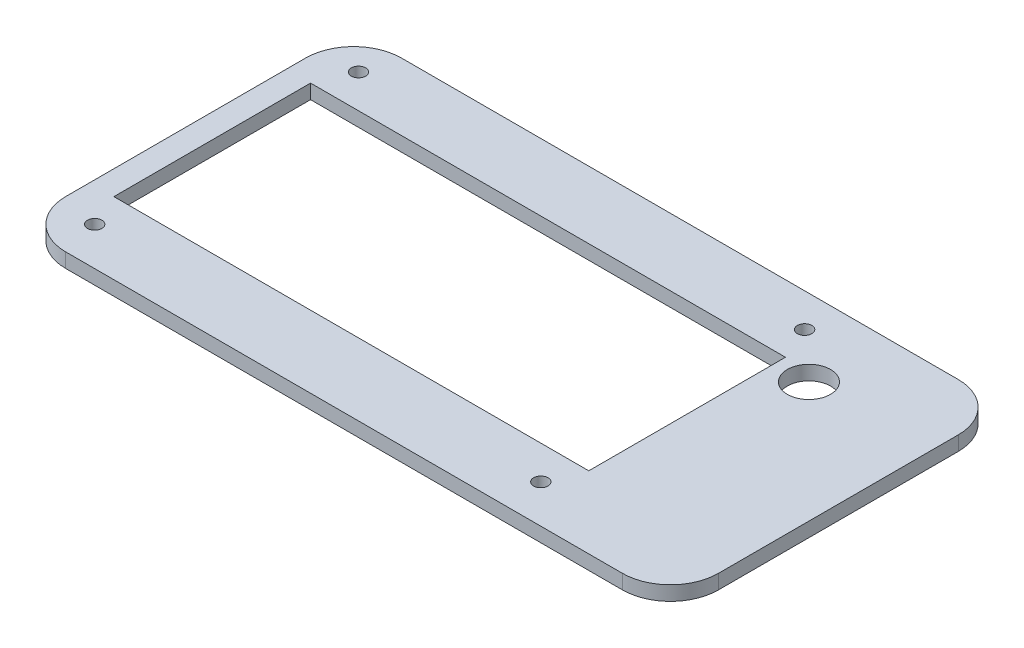
ISO-10303-21;
HEADER;
FILE_DESCRIPTION(('STEP AP214'),'2;1');
FILE_NAME('part.step','',(''),(''),'','','');
FILE_SCHEMA(('AUTOMOTIVE_DESIGN { 1 0 10303 214 1 1 1 1 }'));
ENDSEC;
DATA;
#1=APPLICATION_CONTEXT('core data for automotive mechanical design processes');
#2=APPLICATION_PROTOCOL_DEFINITION('international standard','automotive_design',2000,#1);
#3=PRODUCT_CONTEXT('',#1,'mechanical');
#4=PRODUCT('Part','Part','',(#3));
#5=PRODUCT_RELATED_PRODUCT_CATEGORY('part','',(#4));
#6=PRODUCT_DEFINITION_FORMATION('','',#4);
#7=PRODUCT_DEFINITION_CONTEXT('part definition',#1,'design');
#8=PRODUCT_DEFINITION('design','',#6,#7);
#9=PRODUCT_DEFINITION_SHAPE('','',#8);
#10=(LENGTH_UNIT() NAMED_UNIT(*) SI_UNIT(.MILLI.,.METRE.));
#11=(NAMED_UNIT(*) PLANE_ANGLE_UNIT() SI_UNIT($,.RADIAN.));
#12=(NAMED_UNIT(*) SI_UNIT($,.STERADIAN.) SOLID_ANGLE_UNIT());
#13=UNCERTAINTY_MEASURE_WITH_UNIT(LENGTH_MEASURE(1.E-05),#10,'distance_accuracy_value','');
#14=(GEOMETRIC_REPRESENTATION_CONTEXT(3) GLOBAL_UNCERTAINTY_ASSIGNED_CONTEXT((#13)) GLOBAL_UNIT_ASSIGNED_CONTEXT((#10,
#11,#12)) REPRESENTATION_CONTEXT('',''));
#15=CARTESIAN_POINT('',(0.,0.,0.));
#16=DIRECTION('',(0.,0.,1.));
#17=DIRECTION('',(1.,0.,0.));
#18=AXIS2_PLACEMENT_3D('',#15,#16,#17);
#19=CARTESIAN_POINT('',(0.,3.,48.0210472379869));
#20=DIRECTION('',(0.,0.,-1.));
#21=DIRECTION('',(-1.,0.,0.));
#22=AXIS2_PLACEMENT_3D('',#19,#20,#21);
#23=PLANE('',#22);
#24=DIRECTION('',(1.,0.,0.));
#25=VECTOR('',#24,1.);
#26=CARTESIAN_POINT('',(0.,0.,48.0210472379869));
#27=LINE('',#26,#25);
#28=CARTESIAN_POINT('',(-56.9683201276189,0.,48.0210472379869));
#29=VERTEX_POINT('',#28);
#30=CARTESIAN_POINT('',(59.0949387205516,0.,48.0210472379869));
#31=VERTEX_POINT('',#30);
#32=EDGE_CURVE('E184',#29,#31,#27,.T.);
#33=ORIENTED_EDGE('',*,*,#32,.T.);
#34=DIRECTION('',(0.,-1.,0.));
#35=VECTOR('',#34,1.);
#36=CARTESIAN_POINT('',(59.0949387205516,3.,48.0210472379869));
#37=LINE('',#36,#35);
#38=CARTESIAN_POINT('',(59.0949387205516,3.,48.0210472379869));
#39=VERTEX_POINT('',#38);
#40=EDGE_CURVE('E11',#39,#31,#37,.T.);
#41=ORIENTED_EDGE('',*,*,#40,.F.);
#42=DIRECTION('',(1.,0.,0.));
#43=VECTOR('',#42,1.);
#44=CARTESIAN_POINT('',(0.,3.,48.0210472379869));
#45=LINE('',#44,#43);
#46=CARTESIAN_POINT('',(-56.9683201276189,3.,48.0210472379869));
#47=VERTEX_POINT('',#46);
#48=EDGE_CURVE('E317',#47,#39,#45,.T.);
#49=ORIENTED_EDGE('',*,*,#48,.F.);
#50=DIRECTION('',(0.,-1.,0.));
#51=VECTOR('',#50,1.);
#52=CARTESIAN_POINT('',(-56.9683201276189,3.,48.0210472379869));
#53=LINE('',#52,#51);
#54=EDGE_CURVE('E202',#47,#29,#53,.T.);
#55=ORIENTED_EDGE('',*,*,#54,.T.);
#56=EDGE_LOOP('',(#33,#41,#49,#55));
#57=FACE_BOUND('',#56,.T.);
#58=ADVANCED_FACE('F34',(#57),#23,.F.);
#59=CARTESIAN_POINT('',(59.0949387205516,3.,38.0210472379869));
#60=DIRECTION('',(0.,-1.,0.));
#61=DIRECTION('',(0.,0.,-1.));
#62=AXIS2_PLACEMENT_3D('',#59,#60,#61);
#63=CYLINDRICAL_SURFACE('',#62,10.);
#64=CARTESIAN_POINT('',(59.0949387205516,0.,38.0210472379869));
#65=DIRECTION('',(0.,1.,0.));
#66=DIRECTION('',(0.,0.,1.));
#67=AXIS2_PLACEMENT_3D('',#64,#65,#66);
#68=CIRCLE('',#67,10.);
#69=CARTESIAN_POINT('',(69.0949387205516,0.,38.0210472379869));
#70=VERTEX_POINT('',#69);
#71=EDGE_CURVE('E187',#31,#70,#68,.T.);
#72=ORIENTED_EDGE('',*,*,#71,.T.);
#73=DIRECTION('',(0.,-1.,0.));
#74=VECTOR('',#73,1.);
#75=CARTESIAN_POINT('',(69.0949387205516,3.,38.0210472379869));
#76=LINE('',#75,#74);
#77=CARTESIAN_POINT('',(69.0949387205516,3.,38.0210472379869));
#78=VERTEX_POINT('',#77);
#79=EDGE_CURVE('E44',#78,#70,#76,.T.);
#80=ORIENTED_EDGE('',*,*,#79,.F.);
#81=CARTESIAN_POINT('',(59.0949387205516,3.,38.0210472379869));
#82=DIRECTION('',(0.,1.,0.));
#83=DIRECTION('',(0.,0.,1.));
#84=AXIS2_PLACEMENT_3D('',#81,#82,#83);
#85=CIRCLE('',#84,10.);
#86=EDGE_CURVE('E313',#39,#78,#85,.T.);
#87=ORIENTED_EDGE('',*,*,#86,.F.);
#88=ORIENTED_EDGE('',*,*,#40,.T.);
#89=EDGE_LOOP('',(#72,#80,#87,#88));
#90=FACE_BOUND('',#89,.T.);
#91=ADVANCED_FACE('F248',(#90),#63,.T.);
#92=CARTESIAN_POINT('',(69.0949387205516,3.,0.));
#93=DIRECTION('',(-1.,0.,0.));
#94=DIRECTION('',(0.,0.,1.));
#95=AXIS2_PLACEMENT_3D('',#92,#93,#94);
#96=PLANE('',#95);
#97=DIRECTION('',(0.,0.,-1.));
#98=VECTOR('',#97,1.);
#99=CARTESIAN_POINT('',(69.0949387205516,0.,0.));
#100=LINE('',#99,#98);
#101=CARTESIAN_POINT('',(69.0949387205516,0.,-11.9789527620131));
#102=VERTEX_POINT('',#101);
#103=EDGE_CURVE('E189',#70,#102,#100,.T.);
#104=ORIENTED_EDGE('',*,*,#103,.T.);
#105=DIRECTION('',(0.,-1.,0.));
#106=VECTOR('',#105,1.);
#107=CARTESIAN_POINT('',(69.0949387205516,3.,-11.9789527620131));
#108=LINE('',#107,#106);
#109=CARTESIAN_POINT('',(69.0949387205516,3.,-11.9789527620131));
#110=VERTEX_POINT('',#109);
#111=EDGE_CURVE('E208',#110,#102,#108,.T.);
#112=ORIENTED_EDGE('',*,*,#111,.F.);
#113=DIRECTION('',(0.,0.,-1.));
#114=VECTOR('',#113,1.);
#115=CARTESIAN_POINT('',(69.0949387205516,3.,0.));
#116=LINE('',#115,#114);
#117=EDGE_CURVE('E311',#78,#110,#116,.T.);
#118=ORIENTED_EDGE('',*,*,#117,.F.);
#119=ORIENTED_EDGE('',*,*,#79,.T.);
#120=EDGE_LOOP('',(#104,#112,#118,#119));
#121=FACE_BOUND('',#120,.T.);
#122=ADVANCED_FACE('F254',(#121),#96,.F.);
#123=CARTESIAN_POINT('',(59.0949387205516,3.,-11.9789527620131));
#124=DIRECTION('',(0.,-1.,0.));
#125=DIRECTION('',(0.,0.,-1.));
#126=AXIS2_PLACEMENT_3D('',#123,#124,#125);
#127=CYLINDRICAL_SURFACE('',#126,10.);
#128=CARTESIAN_POINT('',(59.0949387205516,0.,-11.9789527620131));
#129=DIRECTION('',(0.,1.,0.));
#130=DIRECTION('',(0.,0.,1.));
#131=AXIS2_PLACEMENT_3D('',#128,#129,#130);
#132=CIRCLE('',#131,10.);
#133=CARTESIAN_POINT('',(59.0949387205516,0.,-21.9789527620131));
#134=VERTEX_POINT('',#133);
#135=EDGE_CURVE('E192',#134,#102,#132,.F.);
#136=ORIENTED_EDGE('',*,*,#135,.F.);
#137=DIRECTION('',(0.,-1.,0.));
#138=VECTOR('',#137,1.);
#139=CARTESIAN_POINT('',(59.0949387205516,3.,-21.9789527620131));
#140=LINE('',#139,#138);
#141=CARTESIAN_POINT('',(59.0949387205516,3.,-21.9789527620131));
#142=VERTEX_POINT('',#141);
#143=EDGE_CURVE('E206',#142,#134,#140,.T.);
#144=ORIENTED_EDGE('',*,*,#143,.F.);
#145=CARTESIAN_POINT('',(59.0949387205516,3.,-11.9789527620131));
#146=DIRECTION('',(0.,1.,0.));
#147=DIRECTION('',(0.,0.,1.));
#148=AXIS2_PLACEMENT_3D('',#145,#146,#147);
#149=CIRCLE('',#148,10.);
#150=EDGE_CURVE('E310',#142,#110,#149,.F.);
#151=ORIENTED_EDGE('',*,*,#150,.T.);
#152=ORIENTED_EDGE('',*,*,#111,.T.);
#153=EDGE_LOOP('',(#136,#144,#151,#152));
#154=FACE_BOUND('',#153,.T.);
#155=ADVANCED_FACE('F293',(#154),#127,.T.);
#156=CARTESIAN_POINT('',(0.,3.,-21.9789527620131));
#157=DIRECTION('',(0.,0.,-1.));
#158=DIRECTION('',(-1.,0.,0.));
#159=AXIS2_PLACEMENT_3D('',#156,#157,#158);
#160=PLANE('',#159);
#161=DIRECTION('',(1.,0.,0.));
#162=VECTOR('',#161,1.);
#163=CARTESIAN_POINT('',(0.,0.,-21.9789527620131));
#164=LINE('',#163,#162);
#165=CARTESIAN_POINT('',(-56.9683201276189,0.,-21.9789527620131));
#166=VERTEX_POINT('',#165);
#167=EDGE_CURVE('E195',#166,#134,#164,.T.);
#168=ORIENTED_EDGE('',*,*,#167,.F.);
#169=DIRECTION('',(0.,-1.,0.));
#170=VECTOR('',#169,1.);
#171=CARTESIAN_POINT('',(-56.9683201276189,3.,-21.9789527620131));
#172=LINE('',#171,#170);
#173=CARTESIAN_POINT('',(-56.9683201276189,3.,-21.9789527620131));
#174=VERTEX_POINT('',#173);
#175=EDGE_CURVE('E149',#174,#166,#172,.T.);
#176=ORIENTED_EDGE('',*,*,#175,.F.);
#177=DIRECTION('',(1.,0.,0.));
#178=VECTOR('',#177,1.);
#179=CARTESIAN_POINT('',(0.,3.,-21.9789527620131));
#180=LINE('',#179,#178);
#181=EDGE_CURVE('E142',#174,#142,#180,.T.);
#182=ORIENTED_EDGE('',*,*,#181,.T.);
#183=ORIENTED_EDGE('',*,*,#143,.T.);
#184=EDGE_LOOP('',(#168,#176,#182,#183));
#185=FACE_BOUND('',#184,.T.);
#186=ADVANCED_FACE('F290',(#185),#160,.T.);
#187=CARTESIAN_POINT('',(-56.9683201276189,3.,-11.9789527620131));
#188=DIRECTION('',(0.,-1.,0.));
#189=DIRECTION('',(0.,0.,-1.));
#190=AXIS2_PLACEMENT_3D('',#187,#188,#189);
#191=CYLINDRICAL_SURFACE('',#190,10.);
#192=CARTESIAN_POINT('',(-56.9683201276189,0.,-11.9789527620131));
#193=DIRECTION('',(0.,1.,0.));
#194=DIRECTION('',(0.,0.,1.));
#195=AXIS2_PLACEMENT_3D('',#192,#193,#194);
#196=CIRCLE('',#195,10.);
#197=CARTESIAN_POINT('',(-66.9683201276189,0.,-11.9789527620131));
#198=VERTEX_POINT('',#197);
#199=EDGE_CURVE('E148',#166,#198,#196,.T.);
#200=ORIENTED_EDGE('',*,*,#199,.T.);
#201=DIRECTION('',(0.,-1.,0.));
#202=VECTOR('',#201,1.);
#203=CARTESIAN_POINT('',(-66.9683201276189,3.,-11.9789527620131));
#204=LINE('',#203,#202);
#205=CARTESIAN_POINT('',(-66.9683201276189,3.,-11.9789527620131));
#206=VERTEX_POINT('',#205);
#207=EDGE_CURVE('E145',#206,#198,#204,.T.);
#208=ORIENTED_EDGE('',*,*,#207,.F.);
#209=CARTESIAN_POINT('',(-56.9683201276189,3.,-11.9789527620131));
#210=DIRECTION('',(0.,1.,0.));
#211=DIRECTION('',(0.,0.,1.));
#212=AXIS2_PLACEMENT_3D('',#209,#210,#211);
#213=CIRCLE('',#212,10.);
#214=EDGE_CURVE('E135',#174,#206,#213,.T.);
#215=ORIENTED_EDGE('',*,*,#214,.F.);
#216=ORIENTED_EDGE('',*,*,#175,.T.);
#217=EDGE_LOOP('',(#200,#208,#215,#216));
#218=FACE_BOUND('',#217,.T.);
#219=ADVANCED_FACE('F146',(#218),#191,.T.);
#220=CARTESIAN_POINT('',(-66.9683201276189,3.,0.));
#221=DIRECTION('',(1.,0.,0.));
#222=DIRECTION('',(0.,0.,-1.));
#223=AXIS2_PLACEMENT_3D('',#220,#221,#222);
#224=PLANE('',#223);
#225=DIRECTION('',(0.,0.,1.));
#226=VECTOR('',#225,1.);
#227=CARTESIAN_POINT('',(-66.9683201276189,0.,0.));
#228=LINE('',#227,#226);
#229=CARTESIAN_POINT('',(-66.9683201276189,0.,38.0210472379869));
#230=VERTEX_POINT('',#229);
#231=EDGE_CURVE('E94',#198,#230,#228,.T.);
#232=ORIENTED_EDGE('',*,*,#231,.T.);
#233=DIRECTION('',(0.,-1.,0.));
#234=VECTOR('',#233,1.);
#235=CARTESIAN_POINT('',(-66.9683201276189,3.,38.0210472379869));
#236=LINE('',#235,#234);
#237=CARTESIAN_POINT('',(-66.9683201276189,3.,38.0210472379869));
#238=VERTEX_POINT('',#237);
#239=EDGE_CURVE('E150',#238,#230,#236,.T.);
#240=ORIENTED_EDGE('',*,*,#239,.F.);
#241=DIRECTION('',(0.,0.,1.));
#242=VECTOR('',#241,1.);
#243=CARTESIAN_POINT('',(-66.9683201276189,3.,0.));
#244=LINE('',#243,#242);
#245=EDGE_CURVE('E139',#206,#238,#244,.T.);
#246=ORIENTED_EDGE('',*,*,#245,.F.);
#247=ORIENTED_EDGE('',*,*,#207,.T.);
#248=EDGE_LOOP('',(#232,#240,#246,#247));
#249=FACE_BOUND('',#248,.T.);
#250=ADVANCED_FACE('F152',(#249),#224,.F.);
#251=CARTESIAN_POINT('',(-61.9317198399193,3.,0.));
#252=DIRECTION('',(1.,0.,0.));
#253=DIRECTION('',(0.,0.,-1.));
#254=AXIS2_PLACEMENT_3D('',#251,#252,#253);
#255=PLANE('',#254);
#256=DIRECTION('',(0.,0.,1.));
#257=VECTOR('',#256,1.);
#258=CARTESIAN_POINT('',(-61.9317198399193,0.,0.));
#259=LINE('',#258,#257);
#260=CARTESIAN_POINT('',(-61.9317198399193,0.,-7.97895276201312));
#261=VERTEX_POINT('',#260);
#262=CARTESIAN_POINT('',(-61.9317198399193,0.,33.0210472379869));
#263=VERTEX_POINT('',#262);
#264=EDGE_CURVE('E158',#261,#263,#259,.T.);
#265=ORIENTED_EDGE('',*,*,#264,.F.);
#266=DIRECTION('',(0.,-1.,0.));
#267=VECTOR('',#266,1.);
#268=CARTESIAN_POINT('',(-61.9317198399193,3.,-7.97895276201312));
#269=LINE('',#268,#267);
#270=CARTESIAN_POINT('',(-61.9317198399193,3.,-7.97895276201312));
#271=VERTEX_POINT('',#270);
#272=EDGE_CURVE('E38',#271,#261,#269,.T.);
#273=ORIENTED_EDGE('',*,*,#272,.F.);
#274=DIRECTION('',(0.,0.,1.));
#275=VECTOR('',#274,1.);
#276=CARTESIAN_POINT('',(-61.9317198399193,3.,0.));
#277=LINE('',#276,#275);
#278=CARTESIAN_POINT('',(-61.9317198399193,3.,33.0210472379869));
#279=VERTEX_POINT('',#278);
#280=EDGE_CURVE('E201',#271,#279,#277,.T.);
#281=ORIENTED_EDGE('',*,*,#280,.T.);
#282=DIRECTION('',(0.,-1.,0.));
#283=VECTOR('',#282,1.);
#284=CARTESIAN_POINT('',(-61.9317198399193,3.,33.0210472379869));
#285=LINE('',#284,#283);
#286=EDGE_CURVE('E154',#279,#263,#285,.T.);
#287=ORIENTED_EDGE('',*,*,#286,.T.);
#288=EDGE_LOOP('',(#265,#273,#281,#287));
#289=FACE_BOUND('',#288,.T.);
#290=ADVANCED_FACE('F36',(#289),#255,.T.);
#291=CARTESIAN_POINT('',(0.,3.,-7.97895276201312));
#292=DIRECTION('',(0.,0.,-1.));
#293=DIRECTION('',(-1.,0.,0.));
#294=AXIS2_PLACEMENT_3D('',#291,#292,#293);
#295=PLANE('',#294);
#296=DIRECTION('',(1.,0.,0.));
#297=VECTOR('',#296,1.);
#298=CARTESIAN_POINT('',(0.,0.,-7.97895276201312));
#299=LINE('',#298,#297);
#300=CARTESIAN_POINT('',(37.0682801600808,0.,-7.97895276201312));
#301=VERTEX_POINT('',#300);
#302=EDGE_CURVE('E161',#261,#301,#299,.T.);
#303=ORIENTED_EDGE('',*,*,#302,.T.);
#304=DIRECTION('',(0.,-1.,0.));
#305=VECTOR('',#304,1.);
#306=CARTESIAN_POINT('',(37.0682801600808,3.,-7.97895276201312));
#307=LINE('',#306,#305);
#308=CARTESIAN_POINT('',(37.0682801600808,3.,-7.97895276201312));
#309=VERTEX_POINT('',#308);
#310=EDGE_CURVE('E214',#309,#301,#307,.T.);
#311=ORIENTED_EDGE('',*,*,#310,.F.);
#312=DIRECTION('',(1.,0.,0.));
#313=VECTOR('',#312,1.);
#314=CARTESIAN_POINT('',(0.,3.,-7.97895276201312));
#315=LINE('',#314,#313);
#316=EDGE_CURVE('E223',#271,#309,#315,.T.);
#317=ORIENTED_EDGE('',*,*,#316,.F.);
#318=ORIENTED_EDGE('',*,*,#272,.T.);
#319=EDGE_LOOP('',(#303,#311,#317,#318));
#320=FACE_BOUND('',#319,.T.);
#321=ADVANCED_FACE('F222',(#320),#295,.F.);
#322=CARTESIAN_POINT('',(37.0682801600808,3.,0.));
#323=DIRECTION('',(1.,0.,0.));
#324=DIRECTION('',(0.,0.,-1.));
#325=AXIS2_PLACEMENT_3D('',#322,#323,#324);
#326=PLANE('',#325);
#327=DIRECTION('',(0.,0.,1.));
#328=VECTOR('',#327,1.);
#329=CARTESIAN_POINT('',(37.0682801600808,0.,0.));
#330=LINE('',#329,#328);
#331=CARTESIAN_POINT('',(37.0682801600808,0.,33.0210472379869));
#332=VERTEX_POINT('',#331);
#333=EDGE_CURVE('E163',#301,#332,#330,.T.);
#334=ORIENTED_EDGE('',*,*,#333,.T.);
#335=DIRECTION('',(0.,-1.,0.));
#336=VECTOR('',#335,1.);
#337=CARTESIAN_POINT('',(37.0682801600808,3.,33.0210472379869));
#338=LINE('',#337,#336);
#339=CARTESIAN_POINT('',(37.0682801600808,3.,33.0210472379869));
#340=VERTEX_POINT('',#339);
#341=EDGE_CURVE('E213',#340,#332,#338,.T.);
#342=ORIENTED_EDGE('',*,*,#341,.F.);
#343=DIRECTION('',(0.,0.,1.));
#344=VECTOR('',#343,1.);
#345=CARTESIAN_POINT('',(37.0682801600808,3.,0.));
#346=LINE('',#345,#344);
#347=EDGE_CURVE('E335',#309,#340,#346,.T.);
#348=ORIENTED_EDGE('',*,*,#347,.F.);
#349=ORIENTED_EDGE('',*,*,#310,.T.);
#350=EDGE_LOOP('',(#334,#342,#348,#349));
#351=FACE_BOUND('',#350,.T.);
#352=ADVANCED_FACE('F235',(#351),#326,.F.);
#353=CARTESIAN_POINT('',(43.9682801600807,3.,-5.97895276201308));
#354=DIRECTION('',(0.,-1.,0.));
#355=DIRECTION('',(0.,0.,-1.));
#356=AXIS2_PLACEMENT_3D('',#353,#354,#355);
#357=CYLINDRICAL_SURFACE('',#356,4.5);
#358=CARTESIAN_POINT('',(43.9682801600807,3.,-5.97895276201308));
#359=DIRECTION('',(0.,1.,0.));
#360=DIRECTION('',(0.,0.,1.));
#361=AXIS2_PLACEMENT_3D('',#358,#359,#360);
#362=CIRCLE('',#361,4.5);
#363=CARTESIAN_POINT('',(43.9682801600807,3.,-1.47895276201308));
#364=VERTEX_POINT('',#363);
#365=EDGE_CURVE('E319',#364,#364,#362,.T.);
#366=ORIENTED_EDGE('',*,*,#365,.T.);
#367=EDGE_LOOP('',(#366));
#368=FACE_BOUND('',#367,.T.);
#369=CARTESIAN_POINT('',(43.9682801600807,0.,-5.97895276201308));
#370=DIRECTION('',(0.,1.,0.));
#371=DIRECTION('',(0.,0.,1.));
#372=AXIS2_PLACEMENT_3D('',#369,#370,#371);
#373=CIRCLE('',#372,4.5);
#374=CARTESIAN_POINT('',(43.9682801600807,0.,-1.47895276201308));
#375=VERTEX_POINT('',#374);
#376=EDGE_CURVE('E181',#375,#375,#373,.T.);
#377=ORIENTED_EDGE('',*,*,#376,.F.);
#378=EDGE_LOOP('',(#377));
#379=FACE_BOUND('',#378,.T.);
#380=ADVANCED_FACE('F237',(#368,#379),#357,.F.);
#381=CARTESIAN_POINT('',(34.0682801600807,3.,40.0210472379869));
#382=DIRECTION('',(0.,-1.,0.));
#383=DIRECTION('',(0.,0.,-1.));
#384=AXIS2_PLACEMENT_3D('',#381,#382,#383);
#385=CYLINDRICAL_SURFACE('',#384,1.5);
#386=CARTESIAN_POINT('',(34.0682801600807,3.,40.0210472379869));
#387=DIRECTION('',(0.,1.,0.));
#388=DIRECTION('',(0.,0.,1.));
#389=AXIS2_PLACEMENT_3D('',#386,#387,#388);
#390=CIRCLE('',#389,1.5);
#391=CARTESIAN_POINT('',(34.0682801600807,3.,41.5210472379869));
#392=VERTEX_POINT('',#391);
#393=EDGE_CURVE('E322',#392,#392,#390,.T.);
#394=ORIENTED_EDGE('',*,*,#393,.T.);
#395=EDGE_LOOP('',(#394));
#396=FACE_BOUND('',#395,.T.);
#397=CARTESIAN_POINT('',(34.0682801600807,0.,40.0210472379869));
#398=DIRECTION('',(0.,1.,0.));
#399=DIRECTION('',(0.,0.,1.));
#400=AXIS2_PLACEMENT_3D('',#397,#398,#399);
#401=CIRCLE('',#400,1.5);
#402=CARTESIAN_POINT('',(34.0682801600807,0.,41.5210472379869));
#403=VERTEX_POINT('',#402);
#404=EDGE_CURVE('E178',#403,#403,#401,.T.);
#405=ORIENTED_EDGE('',*,*,#404,.F.);
#406=EDGE_LOOP('',(#405));
#407=FACE_BOUND('',#406,.T.);
#408=ADVANCED_FACE('F243',(#396,#407),#385,.F.);
#409=CARTESIAN_POINT('',(-58.9317198399193,3.,40.0210472379869));
#410=DIRECTION('',(0.,-1.,0.));
#411=DIRECTION('',(0.,0.,-1.));
#412=AXIS2_PLACEMENT_3D('',#409,#410,#411);
#413=CYLINDRICAL_SURFACE('',#412,1.5);
#414=CARTESIAN_POINT('',(-58.9317198399193,3.,40.0210472379869));
#415=DIRECTION('',(0.,1.,0.));
#416=DIRECTION('',(0.,0.,1.));
#417=AXIS2_PLACEMENT_3D('',#414,#415,#416);
#418=CIRCLE('',#417,1.5);
#419=CARTESIAN_POINT('',(-58.9317198399193,3.,41.5210472379869));
#420=VERTEX_POINT('',#419);
#421=EDGE_CURVE('E325',#420,#420,#418,.T.);
#422=ORIENTED_EDGE('',*,*,#421,.T.);
#423=EDGE_LOOP('',(#422));
#424=FACE_BOUND('',#423,.T.);
#425=CARTESIAN_POINT('',(-58.9317198399193,0.,40.0210472379869));
#426=DIRECTION('',(0.,1.,0.));
#427=DIRECTION('',(0.,0.,1.));
#428=AXIS2_PLACEMENT_3D('',#425,#426,#427);
#429=CIRCLE('',#428,1.5);
#430=CARTESIAN_POINT('',(-58.9317198399193,0.,41.5210472379869));
#431=VERTEX_POINT('',#430);
#432=EDGE_CURVE('E175',#431,#431,#429,.T.);
#433=ORIENTED_EDGE('',*,*,#432,.F.);
#434=EDGE_LOOP('',(#433));
#435=FACE_BOUND('',#434,.T.);
#436=ADVANCED_FACE('F261',(#424,#435),#413,.F.);
#437=CARTESIAN_POINT('',(34.0682801600807,3.,-14.9789527620131));
#438=DIRECTION('',(0.,-1.,0.));
#439=DIRECTION('',(0.,0.,-1.));
#440=AXIS2_PLACEMENT_3D('',#437,#438,#439);
#441=CYLINDRICAL_SURFACE('',#440,1.5);
#442=CARTESIAN_POINT('',(34.0682801600807,3.,-14.9789527620131));
#443=DIRECTION('',(0.,1.,0.));
#444=DIRECTION('',(0.,0.,1.));
#445=AXIS2_PLACEMENT_3D('',#442,#443,#444);
#446=CIRCLE('',#445,1.5);
#447=CARTESIAN_POINT('',(34.0682801600807,3.,-13.4789527620131));
#448=VERTEX_POINT('',#447);
#449=EDGE_CURVE('E328',#448,#448,#446,.T.);
#450=ORIENTED_EDGE('',*,*,#449,.T.);
#451=EDGE_LOOP('',(#450));
#452=FACE_BOUND('',#451,.T.);
#453=CARTESIAN_POINT('',(34.0682801600807,0.,-14.9789527620131));
#454=DIRECTION('',(0.,1.,0.));
#455=DIRECTION('',(0.,0.,1.));
#456=AXIS2_PLACEMENT_3D('',#453,#454,#455);
#457=CIRCLE('',#456,1.5);
#458=CARTESIAN_POINT('',(34.0682801600807,0.,-13.4789527620131));
#459=VERTEX_POINT('',#458);
#460=EDGE_CURVE('E172',#459,#459,#457,.T.);
#461=ORIENTED_EDGE('',*,*,#460,.F.);
#462=EDGE_LOOP('',(#461));
#463=FACE_BOUND('',#462,.T.);
#464=ADVANCED_FACE('F265',(#452,#463),#441,.F.);
#465=CARTESIAN_POINT('',(-58.9317198399193,3.,-14.9789527620131));
#466=DIRECTION('',(0.,-1.,0.));
#467=DIRECTION('',(0.,0.,-1.));
#468=AXIS2_PLACEMENT_3D('',#465,#466,#467);
#469=CYLINDRICAL_SURFACE('',#468,1.5);
#470=CARTESIAN_POINT('',(-58.9317198399193,3.,-14.9789527620131));
#471=DIRECTION('',(0.,1.,0.));
#472=DIRECTION('',(0.,0.,1.));
#473=AXIS2_PLACEMENT_3D('',#470,#471,#472);
#474=CIRCLE('',#473,1.5);
#475=CARTESIAN_POINT('',(-58.9317198399193,3.,-13.4789527620131));
#476=VERTEX_POINT('',#475);
#477=EDGE_CURVE('E331',#476,#476,#474,.T.);
#478=ORIENTED_EDGE('',*,*,#477,.T.);
#479=EDGE_LOOP('',(#478));
#480=FACE_BOUND('',#479,.T.);
#481=CARTESIAN_POINT('',(-58.9317198399193,0.,-14.9789527620131));
#482=DIRECTION('',(0.,1.,0.));
#483=DIRECTION('',(0.,0.,1.));
#484=AXIS2_PLACEMENT_3D('',#481,#482,#483);
#485=CIRCLE('',#484,1.5);
#486=CARTESIAN_POINT('',(-58.9317198399193,0.,-13.4789527620131));
#487=VERTEX_POINT('',#486);
#488=EDGE_CURVE('E169',#487,#487,#485,.T.);
#489=ORIENTED_EDGE('',*,*,#488,.F.);
#490=EDGE_LOOP('',(#489));
#491=FACE_BOUND('',#490,.T.);
#492=ADVANCED_FACE('F269',(#480,#491),#469,.F.);
#493=CARTESIAN_POINT('',(0.,3.,33.0210472379869));
#494=DIRECTION('',(0.,0.,-1.));
#495=DIRECTION('',(-1.,0.,0.));
#496=AXIS2_PLACEMENT_3D('',#493,#494,#495);
#497=PLANE('',#496);
#498=DIRECTION('',(1.,0.,0.));
#499=VECTOR('',#498,1.);
#500=CARTESIAN_POINT('',(0.,0.,33.0210472379869));
#501=LINE('',#500,#499);
#502=EDGE_CURVE('E166',#263,#332,#501,.T.);
#503=ORIENTED_EDGE('',*,*,#502,.F.);
#504=ORIENTED_EDGE('',*,*,#286,.F.);
#505=DIRECTION('',(1.,0.,0.));
#506=VECTOR('',#505,1.);
#507=CARTESIAN_POINT('',(0.,3.,33.0210472379869));
#508=LINE('',#507,#506);
#509=EDGE_CURVE('E233',#279,#340,#508,.T.);
#510=ORIENTED_EDGE('',*,*,#509,.T.);
#511=ORIENTED_EDGE('',*,*,#341,.T.);
#512=EDGE_LOOP('',(#503,#504,#510,#511));
#513=FACE_BOUND('',#512,.T.);
#514=ADVANCED_FACE('F232',(#513),#497,.T.);
#515=CARTESIAN_POINT('',(-56.9683201276189,3.,38.0210472379869));
#516=DIRECTION('',(0.,-1.,0.));
#517=DIRECTION('',(0.,0.,-1.));
#518=AXIS2_PLACEMENT_3D('',#515,#516,#517);
#519=CYLINDRICAL_SURFACE('',#518,10.);
#520=CARTESIAN_POINT('',(-56.9683201276189,0.,38.0210472379869));
#521=DIRECTION('',(0.,1.,0.));
#522=DIRECTION('',(0.,0.,1.));
#523=AXIS2_PLACEMENT_3D('',#520,#521,#522);
#524=CIRCLE('',#523,10.);
#525=EDGE_CURVE('E100',#230,#29,#524,.T.);
#526=ORIENTED_EDGE('',*,*,#525,.T.);
#527=ORIENTED_EDGE('',*,*,#54,.F.);
#528=CARTESIAN_POINT('',(-56.9683201276189,3.,38.0210472379869));
#529=DIRECTION('',(0.,1.,0.));
#530=DIRECTION('',(0.,0.,1.));
#531=AXIS2_PLACEMENT_3D('',#528,#529,#530);
#532=CIRCLE('',#531,10.);
#533=EDGE_CURVE('E53',#238,#47,#532,.T.);
#534=ORIENTED_EDGE('',*,*,#533,.F.);
#535=ORIENTED_EDGE('',*,*,#239,.T.);
#536=EDGE_LOOP('',(#526,#527,#534,#535));
#537=FACE_BOUND('',#536,.T.);
#538=ADVANCED_FACE('F274',(#537),#519,.T.);
#539=CARTESIAN_POINT('',(0.,3.,0.));
#540=DIRECTION('',(0.,1.,0.));
#541=DIRECTION('',(0.,0.,1.));
#542=AXIS2_PLACEMENT_3D('',#539,#540,#541);
#543=PLANE('',#542);
#544=ORIENTED_EDGE('',*,*,#280,.F.);
#545=ORIENTED_EDGE('',*,*,#316,.T.);
#546=ORIENTED_EDGE('',*,*,#347,.T.);
#547=ORIENTED_EDGE('',*,*,#509,.F.);
#548=EDGE_LOOP('',(#544,#545,#546,#547));
#549=FACE_BOUND('',#548,.T.);
#550=ORIENTED_EDGE('',*,*,#477,.F.);
#551=EDGE_LOOP('',(#550));
#552=FACE_BOUND('',#551,.T.);
#553=ORIENTED_EDGE('',*,*,#449,.F.);
#554=EDGE_LOOP('',(#553));
#555=FACE_BOUND('',#554,.T.);
#556=ORIENTED_EDGE('',*,*,#421,.F.);
#557=EDGE_LOOP('',(#556));
#558=FACE_BOUND('',#557,.T.);
#559=ORIENTED_EDGE('',*,*,#393,.F.);
#560=EDGE_LOOP('',(#559));
#561=FACE_BOUND('',#560,.T.);
#562=ORIENTED_EDGE('',*,*,#365,.F.);
#563=EDGE_LOOP('',(#562));
#564=FACE_BOUND('',#563,.T.);
#565=ORIENTED_EDGE('',*,*,#48,.T.);
#566=ORIENTED_EDGE('',*,*,#86,.T.);
#567=ORIENTED_EDGE('',*,*,#117,.T.);
#568=ORIENTED_EDGE('',*,*,#150,.F.);
#569=ORIENTED_EDGE('',*,*,#181,.F.);
#570=ORIENTED_EDGE('',*,*,#214,.T.);
#571=ORIENTED_EDGE('',*,*,#245,.T.);
#572=ORIENTED_EDGE('',*,*,#533,.T.);
#573=EDGE_LOOP('',(#565,#566,#567,#568,#569,#570,#571,#572));
#574=FACE_BOUND('',#573,.T.);
#575=ADVANCED_FACE('F137',(#549,#552,#555,#558,#561,#564,#574),#543,.T.);
#576=CARTESIAN_POINT('',(0.,0.,0.));
#577=DIRECTION('',(0.,1.,0.));
#578=DIRECTION('',(0.,0.,1.));
#579=AXIS2_PLACEMENT_3D('',#576,#577,#578);
#580=PLANE('',#579);
#581=ORIENTED_EDGE('',*,*,#264,.T.);
#582=ORIENTED_EDGE('',*,*,#502,.T.);
#583=ORIENTED_EDGE('',*,*,#333,.F.);
#584=ORIENTED_EDGE('',*,*,#302,.F.);
#585=EDGE_LOOP('',(#581,#582,#583,#584));
#586=FACE_BOUND('',#585,.T.);
#587=ORIENTED_EDGE('',*,*,#488,.T.);
#588=EDGE_LOOP('',(#587));
#589=FACE_BOUND('',#588,.T.);
#590=ORIENTED_EDGE('',*,*,#460,.T.);
#591=EDGE_LOOP('',(#590));
#592=FACE_BOUND('',#591,.T.);
#593=ORIENTED_EDGE('',*,*,#432,.T.);
#594=EDGE_LOOP('',(#593));
#595=FACE_BOUND('',#594,.T.);
#596=ORIENTED_EDGE('',*,*,#404,.T.);
#597=EDGE_LOOP('',(#596));
#598=FACE_BOUND('',#597,.T.);
#599=ORIENTED_EDGE('',*,*,#376,.T.);
#600=EDGE_LOOP('',(#599));
#601=FACE_BOUND('',#600,.T.);
#602=ORIENTED_EDGE('',*,*,#32,.F.);
#603=ORIENTED_EDGE('',*,*,#525,.F.);
#604=ORIENTED_EDGE('',*,*,#231,.F.);
#605=ORIENTED_EDGE('',*,*,#199,.F.);
#606=ORIENTED_EDGE('',*,*,#167,.T.);
#607=ORIENTED_EDGE('',*,*,#135,.T.);
#608=ORIENTED_EDGE('',*,*,#103,.F.);
#609=ORIENTED_EDGE('',*,*,#71,.F.);
#610=EDGE_LOOP('',(#602,#603,#604,#605,#606,#607,#608,#609));
#611=FACE_BOUND('',#610,.T.);
#612=ADVANCED_FACE('F226',(#586,#589,#592,#595,#598,#601,#611),#580,.F.);
#613=CLOSED_SHELL('',(#58,#91,#122,#155,#186,#219,#250,#290,#321,#352,#380,#408,#436,#464,#492,
#514,#538,#575,#612));
#614=MANIFOLD_SOLID_BREP('B2',#613);
#615=ADVANCED_BREP_SHAPE_REPRESENTATION('',(#18,#614),#14);
#616=SHAPE_DEFINITION_REPRESENTATION(#9,#615);
ENDSEC;
END-ISO-10303-21;
